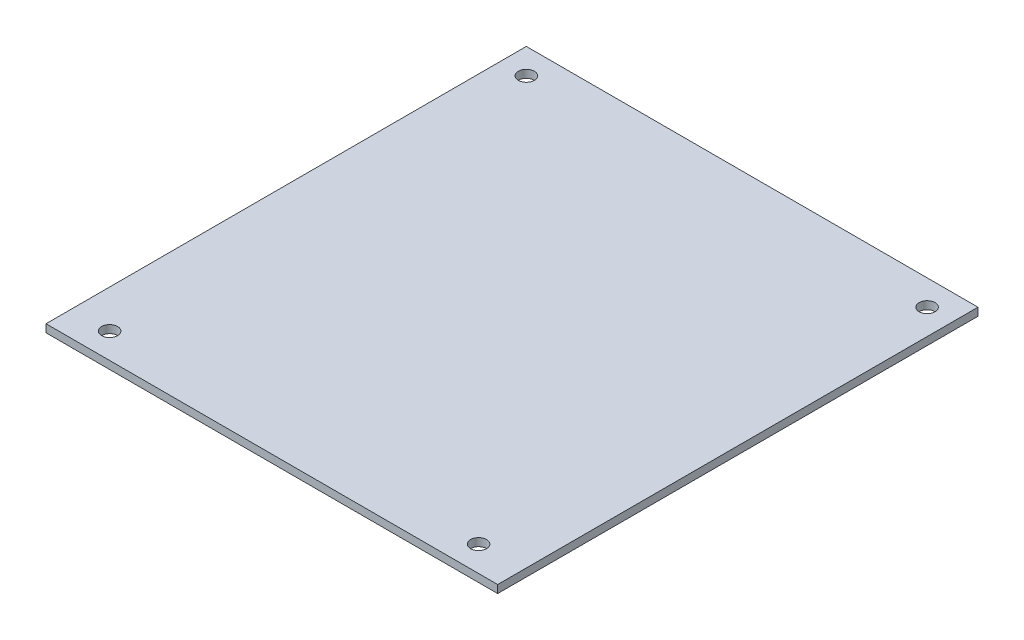
ISO-10303-21;
HEADER;
FILE_DESCRIPTION(('STEP AP214'),'2;1');
FILE_NAME('part.step','',(''),(''),'','','');
FILE_SCHEMA(('AUTOMOTIVE_DESIGN { 1 0 10303 214 1 1 1 1 }'));
ENDSEC;
DATA;
#1=APPLICATION_CONTEXT('core data for automotive mechanical design processes');
#2=APPLICATION_PROTOCOL_DEFINITION('international standard','automotive_design',2000,#1);
#3=PRODUCT_CONTEXT('',#1,'mechanical');
#4=PRODUCT('Part','Part','',(#3));
#5=PRODUCT_RELATED_PRODUCT_CATEGORY('part','',(#4));
#6=PRODUCT_DEFINITION_FORMATION('','',#4);
#7=PRODUCT_DEFINITION_CONTEXT('part definition',#1,'design');
#8=PRODUCT_DEFINITION('design','',#6,#7);
#9=PRODUCT_DEFINITION_SHAPE('','',#8);
#10=(LENGTH_UNIT() NAMED_UNIT(*) SI_UNIT(.MILLI.,.METRE.));
#11=(NAMED_UNIT(*) PLANE_ANGLE_UNIT() SI_UNIT($,.RADIAN.));
#12=(NAMED_UNIT(*) SI_UNIT($,.STERADIAN.) SOLID_ANGLE_UNIT());
#13=UNCERTAINTY_MEASURE_WITH_UNIT(LENGTH_MEASURE(1.E-05),#10,'distance_accuracy_value','');
#14=(GEOMETRIC_REPRESENTATION_CONTEXT(3) GLOBAL_UNCERTAINTY_ASSIGNED_CONTEXT((#13)) GLOBAL_UNIT_ASSIGNED_CONTEXT((#10,
#11,#12)) REPRESENTATION_CONTEXT('',''));
#15=CARTESIAN_POINT('',(0.,0.,0.));
#16=DIRECTION('',(0.,0.,1.));
#17=DIRECTION('',(1.,0.,0.));
#18=AXIS2_PLACEMENT_3D('',#15,#16,#17);
#19=CARTESIAN_POINT('',(-2.65646437973205E-13,0.785,47.945));
#20=DIRECTION('',(0.,0.,-1.));
#21=DIRECTION('',(-1.,0.,0.));
#22=AXIS2_PLACEMENT_3D('',#19,#20,#21);
#23=PLANE('',#22);
#24=DIRECTION('',(1.,0.,0.));
#25=VECTOR('',#24,1.);
#26=CARTESIAN_POINT('',(-2.65646437973205E-13,-0.785,47.945));
#27=LINE('',#26,#25);
#28=CARTESIAN_POINT('',(-45.0850000000005,-0.785,47.9449999999998));
#29=VERTEX_POINT('',#28);
#30=CARTESIAN_POINT('',(45.0849999999995,-0.785,47.9450000000003));
#31=VERTEX_POINT('',#30);
#32=EDGE_CURVE('E117',#29,#31,#27,.T.);
#33=ORIENTED_EDGE('',*,*,#32,.T.);
#34=DIRECTION('',(0.,-1.,0.));
#35=VECTOR('',#34,1.);
#36=CARTESIAN_POINT('',(45.0849999999995,0.785,47.9450000000003));
#37=LINE('',#36,#35);
#38=CARTESIAN_POINT('',(45.0849999999995,0.785,47.9450000000003));
#39=VERTEX_POINT('',#38);
#40=EDGE_CURVE('E11',#39,#31,#37,.T.);
#41=ORIENTED_EDGE('',*,*,#40,.F.);
#42=DIRECTION('',(1.,0.,0.));
#43=VECTOR('',#42,1.);
#44=CARTESIAN_POINT('',(-2.65646437973205E-13,0.785,47.945));
#45=LINE('',#44,#43);
#46=CARTESIAN_POINT('',(-45.0850000000005,0.785,47.9449999999998));
#47=VERTEX_POINT('',#46);
#48=EDGE_CURVE('E93',#47,#39,#45,.T.);
#49=ORIENTED_EDGE('',*,*,#48,.F.);
#50=DIRECTION('',(0.,-1.,0.));
#51=VECTOR('',#50,1.);
#52=CARTESIAN_POINT('',(-45.0850000000005,0.785,47.9449999999998));
#53=LINE('',#52,#51);
#54=EDGE_CURVE('E116',#47,#29,#53,.T.);
#55=ORIENTED_EDGE('',*,*,#54,.T.);
#56=EDGE_LOOP('',(#33,#41,#49,#55));
#57=FACE_BOUND('',#56,.T.);
#58=ADVANCED_FACE('F41',(#57),#23,.F.);
#59=CARTESIAN_POINT('',(45.0849999999998,0.785,2.54474110640287E-13));
#60=DIRECTION('',(-1.,0.,0.));
#61=DIRECTION('',(0.,0.,1.));
#62=AXIS2_PLACEMENT_3D('',#59,#60,#61);
#63=PLANE('',#62);
#64=DIRECTION('',(0.,0.,-1.));
#65=VECTOR('',#64,1.);
#66=CARTESIAN_POINT('',(45.0849999999998,-0.785,2.54474110640287E-13));
#67=LINE('',#66,#65);
#68=CARTESIAN_POINT('',(45.085,-0.785,-47.9449999999998));
#69=VERTEX_POINT('',#68);
#70=EDGE_CURVE('E97',#31,#69,#67,.T.);
#71=ORIENTED_EDGE('',*,*,#70,.T.);
#72=DIRECTION('',(0.,-1.,0.));
#73=VECTOR('',#72,1.);
#74=CARTESIAN_POINT('',(45.085,0.785,-47.9449999999998));
#75=LINE('',#74,#73);
#76=CARTESIAN_POINT('',(45.085,0.785,-47.9449999999998));
#77=VERTEX_POINT('',#76);
#78=EDGE_CURVE('E49',#77,#69,#75,.T.);
#79=ORIENTED_EDGE('',*,*,#78,.F.);
#80=DIRECTION('',(0.,0.,-1.));
#81=VECTOR('',#80,1.);
#82=CARTESIAN_POINT('',(45.0849999999998,0.785,2.54474110640287E-13));
#83=LINE('',#82,#81);
#84=EDGE_CURVE('E87',#39,#77,#83,.T.);
#85=ORIENTED_EDGE('',*,*,#84,.F.);
#86=ORIENTED_EDGE('',*,*,#40,.T.);
#87=EDGE_LOOP('',(#71,#79,#85,#86));
#88=FACE_BOUND('',#87,.T.);
#89=ADVANCED_FACE('F96',(#88),#63,.F.);
#90=CARTESIAN_POINT('',(2.61956904112466E-13,0.785,-47.945));
#91=DIRECTION('',(0.,0.,1.));
#92=DIRECTION('',(1.,0.,0.));
#93=AXIS2_PLACEMENT_3D('',#90,#91,#92);
#94=PLANE('',#93);
#95=DIRECTION('',(-1.,0.,0.));
#96=VECTOR('',#95,1.);
#97=CARTESIAN_POINT('',(2.61956904112466E-13,-0.785,-47.945));
#98=LINE('',#97,#96);
#99=CARTESIAN_POINT('',(-45.085,-0.785,-47.9450000000003));
#100=VERTEX_POINT('',#99);
#101=EDGE_CURVE('E74',#69,#100,#98,.T.);
#102=ORIENTED_EDGE('',*,*,#101,.T.);
#103=DIRECTION('',(0.,-1.,0.));
#104=VECTOR('',#103,1.);
#105=CARTESIAN_POINT('',(-45.085,0.785,-47.9450000000003));
#106=LINE('',#105,#104);
#107=CARTESIAN_POINT('',(-45.085,0.785,-47.9450000000003));
#108=VERTEX_POINT('',#107);
#109=EDGE_CURVE('E98',#108,#100,#106,.T.);
#110=ORIENTED_EDGE('',*,*,#109,.F.);
#111=DIRECTION('',(-1.,0.,0.));
#112=VECTOR('',#111,1.);
#113=CARTESIAN_POINT('',(2.61956904112466E-13,0.785,-47.945));
#114=LINE('',#113,#112);
#115=EDGE_CURVE('E91',#77,#108,#114,.T.);
#116=ORIENTED_EDGE('',*,*,#115,.F.);
#117=ORIENTED_EDGE('',*,*,#78,.T.);
#118=EDGE_LOOP('',(#102,#110,#116,#117));
#119=FACE_BOUND('',#118,.T.);
#120=ADVANCED_FACE('F99',(#119),#94,.F.);
#121=CARTESIAN_POINT('',(40.005,0.785,-42.8649999999998));
#122=DIRECTION('',(0.,-1.,0.));
#123=DIRECTION('',(0.,0.,-1.));
#124=AXIS2_PLACEMENT_3D('',#121,#122,#123);
#125=CYLINDRICAL_SURFACE('',#124,1.59);
#126=CARTESIAN_POINT('',(40.005,0.785,-42.8649999999998));
#127=DIRECTION('',(0.,1.,0.));
#128=DIRECTION('',(0.,0.,1.));
#129=AXIS2_PLACEMENT_3D('',#126,#127,#128);
#130=CIRCLE('',#129,1.59);
#131=CARTESIAN_POINT('',(40.005,0.785,-41.2749999999998));
#132=VERTEX_POINT('',#131);
#133=EDGE_CURVE('E110',#132,#132,#130,.T.);
#134=ORIENTED_EDGE('',*,*,#133,.T.);
#135=EDGE_LOOP('',(#134));
#136=FACE_BOUND('',#135,.T.);
#137=CARTESIAN_POINT('',(40.005,-0.785,-42.8649999999998));
#138=DIRECTION('',(0.,1.,0.));
#139=DIRECTION('',(0.,0.,1.));
#140=AXIS2_PLACEMENT_3D('',#137,#138,#139);
#141=CIRCLE('',#140,1.59);
#142=CARTESIAN_POINT('',(40.005,-0.785,-41.2749999999998));
#143=VERTEX_POINT('',#142);
#144=EDGE_CURVE('E129',#143,#143,#141,.T.);
#145=ORIENTED_EDGE('',*,*,#144,.F.);
#146=EDGE_LOOP('',(#145));
#147=FACE_BOUND('',#146,.T.);
#148=ADVANCED_FACE('F149',(#136,#147),#125,.F.);
#149=CARTESIAN_POINT('',(-37.4650000000005,0.785,42.8649999999998));
#150=DIRECTION('',(0.,-1.,0.));
#151=DIRECTION('',(0.,0.,-1.));
#152=AXIS2_PLACEMENT_3D('',#149,#150,#151);
#153=CYLINDRICAL_SURFACE('',#152,1.59);
#154=CARTESIAN_POINT('',(-37.4650000000005,0.785,42.8649999999998));
#155=DIRECTION('',(0.,1.,0.));
#156=DIRECTION('',(0.,0.,1.));
#157=AXIS2_PLACEMENT_3D('',#154,#155,#156);
#158=CIRCLE('',#157,1.59);
#159=CARTESIAN_POINT('',(-37.4650000000005,0.785,44.4549999999998));
#160=VERTEX_POINT('',#159);
#161=EDGE_CURVE('E107',#160,#160,#158,.T.);
#162=ORIENTED_EDGE('',*,*,#161,.T.);
#163=EDGE_LOOP('',(#162));
#164=FACE_BOUND('',#163,.T.);
#165=CARTESIAN_POINT('',(-37.4650000000005,-0.785,42.8649999999998));
#166=DIRECTION('',(0.,1.,0.));
#167=DIRECTION('',(0.,0.,1.));
#168=AXIS2_PLACEMENT_3D('',#165,#166,#167);
#169=CIRCLE('',#168,1.59);
#170=CARTESIAN_POINT('',(-37.4650000000005,-0.785,44.4549999999998));
#171=VERTEX_POINT('',#170);
#172=EDGE_CURVE('E126',#171,#171,#169,.T.);
#173=ORIENTED_EDGE('',*,*,#172,.F.);
#174=EDGE_LOOP('',(#173));
#175=FACE_BOUND('',#174,.T.);
#176=ADVANCED_FACE('F158',(#164,#175),#153,.F.);
#177=CARTESIAN_POINT('',(-40.005,0.785,-42.8650000000002));
#178=DIRECTION('',(0.,-1.,0.));
#179=DIRECTION('',(0.,0.,-1.));
#180=AXIS2_PLACEMENT_3D('',#177,#178,#179);
#181=CYLINDRICAL_SURFACE('',#180,1.59);
#182=CARTESIAN_POINT('',(-40.005,0.785,-42.8650000000002));
#183=DIRECTION('',(0.,1.,0.));
#184=DIRECTION('',(0.,0.,1.));
#185=AXIS2_PLACEMENT_3D('',#182,#183,#184);
#186=CIRCLE('',#185,1.59);
#187=CARTESIAN_POINT('',(-40.005,0.785,-41.2750000000002));
#188=VERTEX_POINT('',#187);
#189=EDGE_CURVE('E101',#188,#188,#186,.T.);
#190=ORIENTED_EDGE('',*,*,#189,.T.);
#191=EDGE_LOOP('',(#190));
#192=FACE_BOUND('',#191,.T.);
#193=CARTESIAN_POINT('',(-40.005,-0.785,-42.8650000000002));
#194=DIRECTION('',(0.,1.,0.));
#195=DIRECTION('',(0.,0.,1.));
#196=AXIS2_PLACEMENT_3D('',#193,#194,#195);
#197=CIRCLE('',#196,1.59);
#198=CARTESIAN_POINT('',(-40.005,-0.785,-41.2750000000002));
#199=VERTEX_POINT('',#198);
#200=EDGE_CURVE('E123',#199,#199,#197,.T.);
#201=ORIENTED_EDGE('',*,*,#200,.F.);
#202=EDGE_LOOP('',(#201));
#203=FACE_BOUND('',#202,.T.);
#204=ADVANCED_FACE('F155',(#192,#203),#181,.F.);
#205=CARTESIAN_POINT('',(-45.0850000000002,0.785,-2.47949133444385E-13));
#206=DIRECTION('',(1.,0.,0.));
#207=DIRECTION('',(0.,0.,-1.));
#208=AXIS2_PLACEMENT_3D('',#205,#206,#207);
#209=PLANE('',#208);
#210=DIRECTION('',(0.,0.,1.));
#211=VECTOR('',#210,1.);
#212=CARTESIAN_POINT('',(-45.0850000000002,-0.785,-2.47949133444385E-13));
#213=LINE('',#212,#211);
#214=EDGE_CURVE('E80',#100,#29,#213,.T.);
#215=ORIENTED_EDGE('',*,*,#214,.T.);
#216=ORIENTED_EDGE('',*,*,#54,.F.);
#217=DIRECTION('',(0.,0.,1.));
#218=VECTOR('',#217,1.);
#219=CARTESIAN_POINT('',(-45.0850000000002,0.785,-2.47949133444385E-13));
#220=LINE('',#219,#218);
#221=EDGE_CURVE('E57',#108,#47,#220,.T.);
#222=ORIENTED_EDGE('',*,*,#221,.F.);
#223=ORIENTED_EDGE('',*,*,#109,.T.);
#224=EDGE_LOOP('',(#215,#216,#222,#223));
#225=FACE_BOUND('',#224,.T.);
#226=ADVANCED_FACE('F136',(#225),#209,.F.);
#227=CARTESIAN_POINT('',(36.1949999999995,0.785,42.8650000000002));
#228=DIRECTION('',(0.,-1.,0.));
#229=DIRECTION('',(0.,0.,-1.));
#230=AXIS2_PLACEMENT_3D('',#227,#228,#229);
#231=CYLINDRICAL_SURFACE('',#230,1.59000000000001);
#232=CARTESIAN_POINT('',(36.1949999999995,0.785,42.8650000000002));
#233=DIRECTION('',(0.,1.,0.));
#234=DIRECTION('',(0.,0.,1.));
#235=AXIS2_PLACEMENT_3D('',#232,#233,#234);
#236=CIRCLE('',#235,1.59000000000001);
#237=CARTESIAN_POINT('',(36.1949999999995,0.785,44.4550000000002));
#238=VERTEX_POINT('',#237);
#239=EDGE_CURVE('E113',#238,#238,#236,.T.);
#240=ORIENTED_EDGE('',*,*,#239,.T.);
#241=EDGE_LOOP('',(#240));
#242=FACE_BOUND('',#241,.T.);
#243=CARTESIAN_POINT('',(36.1949999999995,-0.785,42.8650000000002));
#244=DIRECTION('',(0.,1.,0.));
#245=DIRECTION('',(0.,0.,1.));
#246=AXIS2_PLACEMENT_3D('',#243,#244,#245);
#247=CIRCLE('',#246,1.59000000000001);
#248=CARTESIAN_POINT('',(36.1949999999995,-0.785,44.4550000000002));
#249=VERTEX_POINT('',#248);
#250=EDGE_CURVE('E132',#249,#249,#247,.T.);
#251=ORIENTED_EDGE('',*,*,#250,.F.);
#252=EDGE_LOOP('',(#251));
#253=FACE_BOUND('',#252,.T.);
#254=ADVANCED_FACE('F154',(#242,#253),#231,.F.);
#255=CARTESIAN_POINT('',(0.,0.785,0.));
#256=DIRECTION('',(0.,1.,0.));
#257=DIRECTION('',(0.,0.,1.));
#258=AXIS2_PLACEMENT_3D('',#255,#256,#257);
#259=PLANE('',#258);
#260=ORIENTED_EDGE('',*,*,#48,.T.);
#261=ORIENTED_EDGE('',*,*,#84,.T.);
#262=ORIENTED_EDGE('',*,*,#115,.T.);
#263=ORIENTED_EDGE('',*,*,#221,.T.);
#264=EDGE_LOOP('',(#260,#261,#262,#263));
#265=FACE_BOUND('',#264,.T.);
#266=ORIENTED_EDGE('',*,*,#189,.F.);
#267=EDGE_LOOP('',(#266));
#268=FACE_BOUND('',#267,.T.);
#269=ORIENTED_EDGE('',*,*,#161,.F.);
#270=EDGE_LOOP('',(#269));
#271=FACE_BOUND('',#270,.T.);
#272=ORIENTED_EDGE('',*,*,#133,.F.);
#273=EDGE_LOOP('',(#272));
#274=FACE_BOUND('',#273,.T.);
#275=ORIENTED_EDGE('',*,*,#239,.F.);
#276=EDGE_LOOP('',(#275));
#277=FACE_BOUND('',#276,.T.);
#278=ADVANCED_FACE('F88',(#265,#268,#271,#274,#277),#259,.T.);
#279=CARTESIAN_POINT('',(0.,-0.785,0.));
#280=DIRECTION('',(0.,1.,0.));
#281=DIRECTION('',(0.,0.,1.));
#282=AXIS2_PLACEMENT_3D('',#279,#280,#281);
#283=PLANE('',#282);
#284=ORIENTED_EDGE('',*,*,#32,.F.);
#285=ORIENTED_EDGE('',*,*,#214,.F.);
#286=ORIENTED_EDGE('',*,*,#101,.F.);
#287=ORIENTED_EDGE('',*,*,#70,.F.);
#288=EDGE_LOOP('',(#284,#285,#286,#287));
#289=FACE_BOUND('',#288,.T.);
#290=ORIENTED_EDGE('',*,*,#200,.T.);
#291=EDGE_LOOP('',(#290));
#292=FACE_BOUND('',#291,.T.);
#293=ORIENTED_EDGE('',*,*,#172,.T.);
#294=EDGE_LOOP('',(#293));
#295=FACE_BOUND('',#294,.T.);
#296=ORIENTED_EDGE('',*,*,#144,.T.);
#297=EDGE_LOOP('',(#296));
#298=FACE_BOUND('',#297,.T.);
#299=ORIENTED_EDGE('',*,*,#250,.T.);
#300=EDGE_LOOP('',(#299));
#301=FACE_BOUND('',#300,.T.);
#302=ADVANCED_FACE('F139',(#289,#292,#295,#298,#301),#283,.F.);
#303=CLOSED_SHELL('',(#58,#89,#120,#148,#176,#204,#226,#254,#278,#302));
#304=MANIFOLD_SOLID_BREP('B2',#303);
#305=ADVANCED_BREP_SHAPE_REPRESENTATION('',(#18,#304),#14);
#306=SHAPE_DEFINITION_REPRESENTATION(#9,#305);
ENDSEC;
END-ISO-10303-21;
